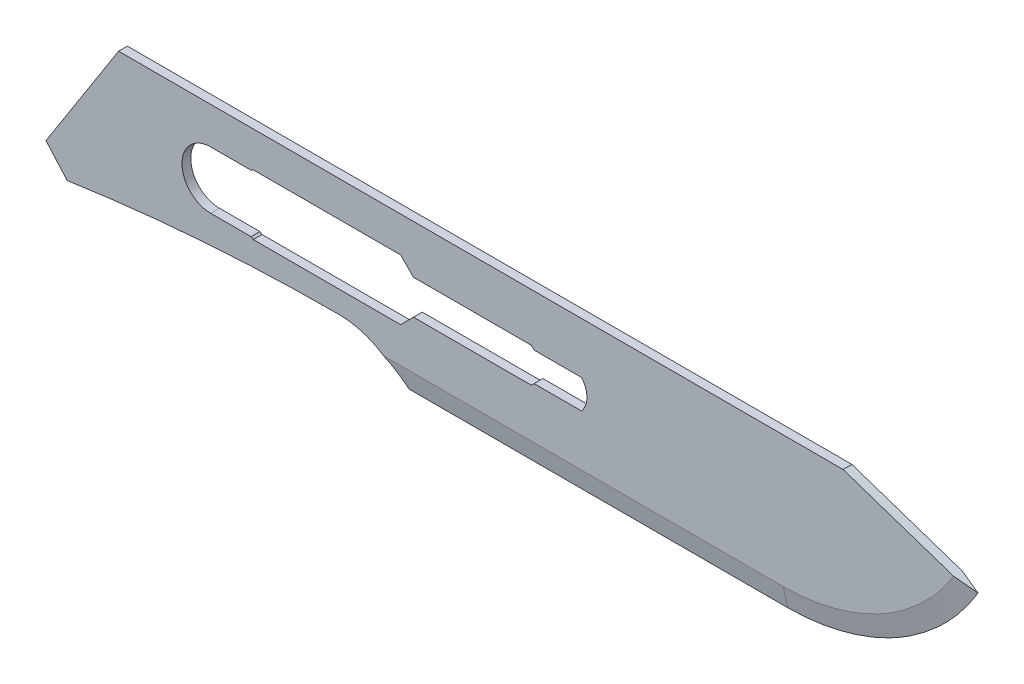
ISO-10303-21;
HEADER;
FILE_DESCRIPTION(('STEP AP214'),'2;1');
FILE_NAME('part.step','',(''),(''),'','','');
FILE_SCHEMA(('AUTOMOTIVE_DESIGN { 1 0 10303 214 1 1 1 1 }'));
ENDSEC;
DATA;
#1=APPLICATION_CONTEXT('core data for automotive mechanical design processes');
#2=APPLICATION_PROTOCOL_DEFINITION('international standard','automotive_design',2000,#1);
#3=PRODUCT_CONTEXT('',#1,'mechanical');
#4=PRODUCT('Part','Part','',(#3));
#5=PRODUCT_RELATED_PRODUCT_CATEGORY('part','',(#4));
#6=PRODUCT_DEFINITION_FORMATION('','',#4);
#7=PRODUCT_DEFINITION_CONTEXT('part definition',#1,'design');
#8=PRODUCT_DEFINITION('design','',#6,#7);
#9=PRODUCT_DEFINITION_SHAPE('','',#8);
#10=(LENGTH_UNIT() NAMED_UNIT(*) SI_UNIT(.MILLI.,.METRE.));
#11=(NAMED_UNIT(*) PLANE_ANGLE_UNIT() SI_UNIT($,.RADIAN.));
#12=(NAMED_UNIT(*) SI_UNIT($,.STERADIAN.) SOLID_ANGLE_UNIT());
#13=UNCERTAINTY_MEASURE_WITH_UNIT(LENGTH_MEASURE(1.E-05),#10,'distance_accuracy_value','');
#14=(GEOMETRIC_REPRESENTATION_CONTEXT(3) GLOBAL_UNCERTAINTY_ASSIGNED_CONTEXT((#13)) GLOBAL_UNIT_ASSIGNED_CONTEXT((#10,
#11,#12)) REPRESENTATION_CONTEXT('',''));
#15=CARTESIAN_POINT('',(0.,0.,0.));
#16=DIRECTION('',(0.,0.,1.));
#17=DIRECTION('',(1.,0.,0.));
#18=AXIS2_PLACEMENT_3D('',#15,#16,#17);
#19=CARTESIAN_POINT('',(-8.255,4.95241381146608,0.1905));
#20=DIRECTION('',(0.,0.,-1.));
#21=DIRECTION('',(-1.,0.,0.));
#22=AXIS2_PLACEMENT_3D('',#19,#20,#21);
#23=PLANE('',#22);
#24=CARTESIAN_POINT('',(-27.5063043070527,-6.6809007025944,0.1905));
#25=DIRECTION('',(0.,0.,-1.));
#26=DIRECTION('',(1.,0.,0.));
#27=AXIS2_PLACEMENT_3D('',#24,#25,#26);
#28=CIRCLE('',#27,3.4798);
#29=CARTESIAN_POINT('',(-27.50566,-3.20110076224317,0.1905));
#30=VERTEX_POINT('',#29);
#31=CARTESIAN_POINT('',(-25.5765775147167,-3.78518618853392,0.1905));
#32=VERTEX_POINT('',#31);
#33=EDGE_CURVE('E221',#30,#32,#28,.T.);
#34=ORIENTED_EDGE('',*,*,#33,.T.);
#35=DIRECTION('',(1.,0.,0.));
#36=VECTOR('',#35,1.);
#37=CARTESIAN_POINT('',(-28.4768617530592,-3.78518618853392,0.1905));
#38=LINE('',#37,#36);
#39=CARTESIAN_POINT('',(-8.255,-3.78518618853392,0.1905));
#40=VERTEX_POINT('',#39);
#41=EDGE_CURVE('E207',#32,#40,#38,.T.);
#42=ORIENTED_EDGE('',*,*,#41,.T.);
#43=CARTESIAN_POINT('',(-8.255,-3.78518618853392,0.1905));
#44=CARTESIAN_POINT('',(-6.63074292012557,-3.78518618853392,0.1905));
#45=CARTESIAN_POINT('',(-4.89180606923125,-3.28825967373008,0.1905));
#46=CARTESIAN_POINT('',(-2.76347399748939,-1.89648040564571,0.1905));
#47=CARTESIAN_POINT('',(-2.1160321854911,-1.31829233518276,0.1905));
#48=CARTESIAN_POINT('',(-1.0631161660207,-0.0760397170998346,0.1905));
#49=CARTESIAN_POINT('',(-0.654782385122332,0.625542975857833,0.1905));
#50=CARTESIAN_POINT('',(-0.26375087755055,1.36218278976257,0.1905));
#51=B_SPLINE_CURVE_WITH_KNOTS('',3,(#43,#44,#45,#46,#47,#48,#49,#50),.UNSPECIFIED.,.F.,.F.,(4,2,
2,4),(0.647701537141901,0.823850768570951,0.911925384285475,1.),.UNSPECIFIED.);
#52=CARTESIAN_POINT('',(-0.873085363511316,0.293638575171968,0.1905));
#53=VERTEX_POINT('',#52);
#54=EDGE_CURVE('E288',#40,#53,#51,.T.);
#55=ORIENTED_EDGE('',*,*,#54,.T.);
#56=DIRECTION('',(-0.947829798780356,0.318776838154828,0.));
#57=VECTOR('',#56,1.);
#58=CARTESIAN_POINT('',(0.,0.,0.1905));
#59=LINE('',#58,#57);
#60=CARTESIAN_POINT('',(-5.6642,1.905,0.1905));
#61=VERTEX_POINT('',#60);
#62=EDGE_CURVE('E250',#53,#61,#59,.T.);
#63=ORIENTED_EDGE('',*,*,#62,.T.);
#64=DIRECTION('',(-1.,0.,0.));
#65=VECTOR('',#64,1.);
#66=CARTESIAN_POINT('',(-5.6642,1.905,0.1905));
#67=LINE('',#66,#65);
#68=CARTESIAN_POINT('',(-37.06114,1.905,0.1905));
#69=VERTEX_POINT('',#68);
#70=EDGE_CURVE('E418',#61,#69,#67,.T.);
#71=ORIENTED_EDGE('',*,*,#70,.T.);
#72=DIRECTION('',(-0.538252158410651,-0.842783847713205,0.));
#73=VECTOR('',#72,1.);
#74=CARTESIAN_POINT('',(-40.2082,-3.0226,0.1905));
#75=LINE('',#74,#73);
#76=CARTESIAN_POINT('',(-40.2082,-3.0226,0.1905));
#77=VERTEX_POINT('',#76);
#78=EDGE_CURVE('E263',#69,#77,#75,.T.);
#79=ORIENTED_EDGE('',*,*,#78,.T.);
#80=DIRECTION('',(0.659801173215096,-0.751440225050524,0.));
#81=VECTOR('',#80,1.);
#82=CARTESIAN_POINT('',(-39.2938,-4.064,0.1905));
#83=LINE('',#82,#81);
#84=CARTESIAN_POINT('',(-39.2938,-4.064,0.1905));
#85=VERTEX_POINT('',#84);
#86=EDGE_CURVE('E234',#77,#85,#83,.T.);
#87=ORIENTED_EDGE('',*,*,#86,.T.);
#88=CARTESIAN_POINT('',(-27.5206107454063,-83.9476993781304,0.1905));
#89=DIRECTION('',(0.,0.,-1.));
#90=DIRECTION('',(1.,0.,0.));
#91=AXIS2_PLACEMENT_3D('',#88,#89,#90);
#92=CIRCLE('',#91,80.7466);
#93=EDGE_CURVE('E228',#85,#30,#92,.T.);
#94=ORIENTED_EDGE('',*,*,#93,.T.);
#95=EDGE_LOOP('',(#34,#42,#55,#63,#71,#79,#87,#94));
#96=FACE_BOUND('',#95,.T.);
#97=DIRECTION('',(-0.815327202637733,-0.579000477235494,0.));
#98=VECTOR('',#97,1.);
#99=CARTESIAN_POINT('',(-31.3182,0.3048,0.1905));
#100=LINE('',#99,#98);
#101=CARTESIAN_POINT('',(-31.2287816326531,0.3683,0.1905));
#102=VERTEX_POINT('',#101);
#103=CARTESIAN_POINT('',(-31.3182,0.3048,0.1905));
#104=VERTEX_POINT('',#103);
#105=EDGE_CURVE('E303',#102,#104,#100,.T.);
#106=ORIENTED_EDGE('',*,*,#105,.F.);
#107=DIRECTION('',(-1.,0.,0.));
#108=VECTOR('',#107,1.);
#109=CARTESIAN_POINT('',(-31.2287816326531,0.3683,0.1905));
#110=LINE('',#109,#108);
#111=CARTESIAN_POINT('',(-24.8412,0.3683,0.1905));
#112=VERTEX_POINT('',#111);
#113=EDGE_CURVE('E482',#112,#102,#110,.T.);
#114=ORIENTED_EDGE('',*,*,#113,.F.);
#115=DIRECTION('',(-0.707106781186546,0.707106781186549,0.));
#116=VECTOR('',#115,1.);
#117=CARTESIAN_POINT('',(-24.8412,0.3683,0.1905));
#118=LINE('',#117,#116);
#119=CARTESIAN_POINT('',(-24.2824,-0.1905,0.1905));
#120=VERTEX_POINT('',#119);
#121=EDGE_CURVE('E531',#120,#112,#118,.T.);
#122=ORIENTED_EDGE('',*,*,#121,.F.);
#123=DIRECTION('',(-1.,0.,0.));
#124=VECTOR('',#123,1.);
#125=CARTESIAN_POINT('',(-24.2824,-0.1905,0.1905));
#126=LINE('',#125,#124);
#127=CARTESIAN_POINT('',(-19.177,-0.1905,0.1905));
#128=VERTEX_POINT('',#127);
#129=EDGE_CURVE('E533',#128,#120,#126,.T.);
#130=ORIENTED_EDGE('',*,*,#129,.F.);
#131=DIRECTION('',(-0.707106781186547,0.707106781186547,0.));
#132=VECTOR('',#131,1.);
#133=CARTESIAN_POINT('',(-19.177,-0.1905,0.1905));
#134=LINE('',#133,#132);
#135=CARTESIAN_POINT('',(-19.05635,-0.31115,0.1905));
#136=VERTEX_POINT('',#135);
#137=EDGE_CURVE('E535',#136,#128,#134,.T.);
#138=ORIENTED_EDGE('',*,*,#137,.F.);
#139=DIRECTION('',(-1.,0.,0.));
#140=VECTOR('',#139,1.);
#141=CARTESIAN_POINT('',(-19.05635,-0.31115,0.1905));
#142=LINE('',#141,#140);
#143=CARTESIAN_POINT('',(-16.99895,-0.31115,0.1905));
#144=VERTEX_POINT('',#143);
#145=EDGE_CURVE('E537',#144,#136,#142,.T.);
#146=ORIENTED_EDGE('',*,*,#145,.F.);
#147=CARTESIAN_POINT('',(-17.7313503123293,-0.9398,0.1905));
#148=DIRECTION('',(0.,0.,1.));
#149=DIRECTION('',(-1.,0.,0.));
#150=AXIS2_PLACEMENT_3D('',#147,#148,#149);
#151=CIRCLE('',#150,0.965199999999999);
#152=CARTESIAN_POINT('',(-16.99895,-1.56845,0.1905));
#153=VERTEX_POINT('',#152);
#154=EDGE_CURVE('E539',#153,#144,#151,.T.);
#155=ORIENTED_EDGE('',*,*,#154,.F.);
#156=DIRECTION('',(1.,0.,0.));
#157=VECTOR('',#156,1.);
#158=CARTESIAN_POINT('',(-19.05635,-1.56845,0.1905));
#159=LINE('',#158,#157);
#160=CARTESIAN_POINT('',(-19.05635,-1.56845,0.1905));
#161=VERTEX_POINT('',#160);
#162=EDGE_CURVE('E541',#161,#153,#159,.T.);
#163=ORIENTED_EDGE('',*,*,#162,.F.);
#164=DIRECTION('',(0.707106781186547,0.707106781186547,0.));
#165=VECTOR('',#164,1.);
#166=CARTESIAN_POINT('',(-19.177,-1.6891,0.1905));
#167=LINE('',#166,#165);
#168=CARTESIAN_POINT('',(-19.177,-1.6891,0.1905));
#169=VERTEX_POINT('',#168);
#170=EDGE_CURVE('E543',#169,#161,#167,.T.);
#171=ORIENTED_EDGE('',*,*,#170,.F.);
#172=DIRECTION('',(1.,0.,0.));
#173=VECTOR('',#172,1.);
#174=CARTESIAN_POINT('',(-24.2824,-1.6891,0.1905));
#175=LINE('',#174,#173);
#176=CARTESIAN_POINT('',(-24.2824,-1.6891,0.1905));
#177=VERTEX_POINT('',#176);
#178=EDGE_CURVE('E545',#177,#169,#175,.T.);
#179=ORIENTED_EDGE('',*,*,#178,.F.);
#180=DIRECTION('',(0.707106781186544,0.707106781186551,0.));
#181=VECTOR('',#180,1.);
#182=CARTESIAN_POINT('',(-24.8412,-2.2479,0.1905));
#183=LINE('',#182,#181);
#184=CARTESIAN_POINT('',(-24.8412,-2.2479,0.1905));
#185=VERTEX_POINT('',#184);
#186=EDGE_CURVE('E547',#185,#177,#183,.T.);
#187=ORIENTED_EDGE('',*,*,#186,.F.);
#188=DIRECTION('',(1.,0.,0.));
#189=VECTOR('',#188,1.);
#190=CARTESIAN_POINT('',(-31.2287816326531,-2.2479,0.1905));
#191=LINE('',#190,#189);
#192=CARTESIAN_POINT('',(-31.2287816326531,-2.2479,0.1905));
#193=VERTEX_POINT('',#192);
#194=EDGE_CURVE('E549',#193,#185,#191,.T.);
#195=ORIENTED_EDGE('',*,*,#194,.F.);
#196=DIRECTION('',(0.815327202637734,-0.579000477235492,0.));
#197=VECTOR('',#196,1.);
#198=CARTESIAN_POINT('',(-31.3182,-2.1844,0.1905));
#199=LINE('',#198,#197);
#200=CARTESIAN_POINT('',(-31.3182,-2.1844,0.1905));
#201=VERTEX_POINT('',#200);
#202=EDGE_CURVE('E551',#201,#193,#199,.T.);
#203=ORIENTED_EDGE('',*,*,#202,.F.);
#204=DIRECTION('',(1.,0.,0.));
#205=VECTOR('',#204,1.);
#206=CARTESIAN_POINT('',(-33.0708,-2.1844,0.1905));
#207=LINE('',#206,#205);
#208=CARTESIAN_POINT('',(-33.0708,-2.1844,0.1905));
#209=VERTEX_POINT('',#208);
#210=EDGE_CURVE('E553',#209,#201,#207,.T.);
#211=ORIENTED_EDGE('',*,*,#210,.F.);
#212=CARTESIAN_POINT('',(-33.0708,-0.9398,0.1905));
#213=DIRECTION('',(0.,0.,1.));
#214=DIRECTION('',(1.,0.,0.));
#215=AXIS2_PLACEMENT_3D('',#212,#213,#214);
#216=CIRCLE('',#215,1.2446);
#217=CARTESIAN_POINT('',(-33.0708,0.3048,0.1905));
#218=VERTEX_POINT('',#217);
#219=EDGE_CURVE('E555',#218,#209,#216,.T.);
#220=ORIENTED_EDGE('',*,*,#219,.F.);
#221=DIRECTION('',(-1.,0.,0.));
#222=VECTOR('',#221,1.);
#223=CARTESIAN_POINT('',(-33.0708,0.3048,0.1905));
#224=LINE('',#223,#222);
#225=EDGE_CURVE('E556',#104,#218,#224,.T.);
#226=ORIENTED_EDGE('',*,*,#225,.F.);
#227=EDGE_LOOP('',(#106,#114,#122,#130,#138,#146,#155,#163,#171,#179,#187,#195,#203,#211,#220,#226));
#228=FACE_BOUND('',#227,.T.);
#229=ADVANCED_FACE('F32',(#96,#228),#23,.F.);
#230=CARTESIAN_POINT('',(-8.255,4.95241381146608,-0.1905));
#231=DIRECTION('',(0.,0.,-1.));
#232=DIRECTION('',(-1.,0.,0.));
#233=AXIS2_PLACEMENT_3D('',#230,#231,#232);
#234=PLANE('',#233);
#235=DIRECTION('',(1.,0.,0.));
#236=VECTOR('',#235,1.);
#237=CARTESIAN_POINT('',(-28.4768617530592,-3.78518618853392,-0.1905));
#238=LINE('',#237,#236);
#239=CARTESIAN_POINT('',(-25.5765775147167,-3.78518618853392,-0.1905));
#240=VERTEX_POINT('',#239);
#241=CARTESIAN_POINT('',(-8.255,-3.78518618853392,-0.1905));
#242=VERTEX_POINT('',#241);
#243=EDGE_CURVE('E214',#240,#242,#238,.T.);
#244=ORIENTED_EDGE('',*,*,#243,.F.);
#245=CARTESIAN_POINT('',(-27.5063043070527,-6.6809007025944,-0.1905));
#246=DIRECTION('',(0.,0.,-1.));
#247=DIRECTION('',(1.,0.,0.));
#248=AXIS2_PLACEMENT_3D('',#245,#246,#247);
#249=CIRCLE('',#248,3.4798);
#250=CARTESIAN_POINT('',(-27.50566,-3.20110076224317,-0.1905));
#251=VERTEX_POINT('',#250);
#252=EDGE_CURVE('E249',#251,#240,#249,.T.);
#253=ORIENTED_EDGE('',*,*,#252,.F.);
#254=CARTESIAN_POINT('',(-27.5206107454063,-83.9476993781304,-0.1905));
#255=DIRECTION('',(0.,0.,-1.));
#256=DIRECTION('',(1.,0.,0.));
#257=AXIS2_PLACEMENT_3D('',#254,#255,#256);
#258=CIRCLE('',#257,80.7466);
#259=CARTESIAN_POINT('',(-39.2938,-4.064,-0.1905));
#260=VERTEX_POINT('',#259);
#261=EDGE_CURVE('E247',#260,#251,#258,.T.);
#262=ORIENTED_EDGE('',*,*,#261,.F.);
#263=DIRECTION('',(0.659801173215096,-0.751440225050524,0.));
#264=VECTOR('',#263,1.);
#265=CARTESIAN_POINT('',(-39.2938,-4.064,-0.1905));
#266=LINE('',#265,#264);
#267=CARTESIAN_POINT('',(-40.2082,-3.0226,-0.1905));
#268=VERTEX_POINT('',#267);
#269=EDGE_CURVE('E245',#268,#260,#266,.T.);
#270=ORIENTED_EDGE('',*,*,#269,.F.);
#271=DIRECTION('',(-0.538252158410651,-0.842783847713205,0.));
#272=VECTOR('',#271,1.);
#273=CARTESIAN_POINT('',(-40.2082,-3.0226,-0.1905));
#274=LINE('',#273,#272);
#275=CARTESIAN_POINT('',(-37.06114,1.905,-0.1905));
#276=VERTEX_POINT('',#275);
#277=EDGE_CURVE('E243',#276,#268,#274,.T.);
#278=ORIENTED_EDGE('',*,*,#277,.F.);
#279=DIRECTION('',(-1.,0.,0.));
#280=VECTOR('',#279,1.);
#281=CARTESIAN_POINT('',(-5.6642,1.905,-0.1905));
#282=LINE('',#281,#280);
#283=CARTESIAN_POINT('',(-5.6642,1.905,-0.1905));
#284=VERTEX_POINT('',#283);
#285=EDGE_CURVE('E240',#284,#276,#282,.T.);
#286=ORIENTED_EDGE('',*,*,#285,.F.);
#287=DIRECTION('',(-0.947829798780356,0.318776838154828,0.));
#288=VECTOR('',#287,1.);
#289=CARTESIAN_POINT('',(0.,0.,-0.1905));
#290=LINE('',#289,#288);
#291=CARTESIAN_POINT('',(-0.873085363513939,0.293638575169909,-0.1905));
#292=VERTEX_POINT('',#291);
#293=EDGE_CURVE('E238',#292,#284,#290,.T.);
#294=ORIENTED_EDGE('',*,*,#293,.F.);
#295=CARTESIAN_POINT('',(-8.255,-3.78518618853392,-0.1905));
#296=CARTESIAN_POINT('',(-6.63074292012557,-3.78518618853392,-0.1905));
#297=CARTESIAN_POINT('',(-4.89180606923125,-3.28825967372683,-0.1905));
#298=CARTESIAN_POINT('',(-2.76347399748939,-1.89648040564734,-0.1905));
#299=CARTESIAN_POINT('',(-2.11603218549031,-1.31829233518276,-0.1905));
#300=CARTESIAN_POINT('',(-1.06311616602148,-0.0760397170998348,-0.1905));
#301=CARTESIAN_POINT('',(-0.654782385125785,0.625542975859977,-0.1905));
#302=CARTESIAN_POINT('',(-0.263750877550548,1.36218278976257,-0.1905));
#303=B_SPLINE_CURVE_WITH_KNOTS('',3,(#295,#296,#297,#298,#299,#300,#301,#302),.UNSPECIFIED.,.F.,
.F.,(4,2,2,4),(0.647701537141901,0.823850768570951,0.911925384285475,1.),.UNSPECIFIED.);
#304=EDGE_CURVE('E282',#242,#292,#303,.T.);
#305=ORIENTED_EDGE('',*,*,#304,.F.);
#306=EDGE_LOOP('',(#244,#253,#262,#270,#278,#286,#294,#305));
#307=FACE_BOUND('',#306,.T.);
#308=DIRECTION('',(-1.,0.,0.));
#309=VECTOR('',#308,1.);
#310=CARTESIAN_POINT('',(-31.2287816326531,0.3683,-0.1905));
#311=LINE('',#310,#309);
#312=CARTESIAN_POINT('',(-24.8412,0.3683,-0.1905));
#313=VERTEX_POINT('',#312);
#314=CARTESIAN_POINT('',(-31.2287816326531,0.3683,-0.1905));
#315=VERTEX_POINT('',#314);
#316=EDGE_CURVE('E483',#313,#315,#311,.T.);
#317=ORIENTED_EDGE('',*,*,#316,.T.);
#318=DIRECTION('',(-0.815327202637733,-0.579000477235494,0.));
#319=VECTOR('',#318,1.);
#320=CARTESIAN_POINT('',(-31.3182,0.3048,-0.1905));
#321=LINE('',#320,#319);
#322=CARTESIAN_POINT('',(-31.3182,0.3048,-0.1905));
#323=VERTEX_POINT('',#322);
#324=EDGE_CURVE('E301',#315,#323,#321,.T.);
#325=ORIENTED_EDGE('',*,*,#324,.T.);
#326=DIRECTION('',(-1.,0.,0.));
#327=VECTOR('',#326,1.);
#328=CARTESIAN_POINT('',(-33.0708,0.3048,-0.1905));
#329=LINE('',#328,#327);
#330=CARTESIAN_POINT('',(-33.0708,0.3048,-0.1905));
#331=VERTEX_POINT('',#330);
#332=EDGE_CURVE('E525',#323,#331,#329,.T.);
#333=ORIENTED_EDGE('',*,*,#332,.T.);
#334=CARTESIAN_POINT('',(-33.0708,-0.9398,-0.1905));
#335=DIRECTION('',(0.,0.,1.));
#336=DIRECTION('',(1.,0.,0.));
#337=AXIS2_PLACEMENT_3D('',#334,#335,#336);
#338=CIRCLE('',#337,1.2446);
#339=CARTESIAN_POINT('',(-33.0708,-2.1844,-0.1905));
#340=VERTEX_POINT('',#339);
#341=EDGE_CURVE('E522',#331,#340,#338,.T.);
#342=ORIENTED_EDGE('',*,*,#341,.T.);
#343=DIRECTION('',(1.,0.,0.));
#344=VECTOR('',#343,1.);
#345=CARTESIAN_POINT('',(-33.0708,-2.1844,-0.1905));
#346=LINE('',#345,#344);
#347=CARTESIAN_POINT('',(-31.3182,-2.1844,-0.1905));
#348=VERTEX_POINT('',#347);
#349=EDGE_CURVE('E519',#340,#348,#346,.T.);
#350=ORIENTED_EDGE('',*,*,#349,.T.);
#351=DIRECTION('',(0.815327202637734,-0.579000477235492,0.));
#352=VECTOR('',#351,1.);
#353=CARTESIAN_POINT('',(-31.3182,-2.1844,-0.1905));
#354=LINE('',#353,#352);
#355=CARTESIAN_POINT('',(-31.2287816326531,-2.2479,-0.1905));
#356=VERTEX_POINT('',#355);
#357=EDGE_CURVE('E516',#348,#356,#354,.T.);
#358=ORIENTED_EDGE('',*,*,#357,.T.);
#359=DIRECTION('',(1.,0.,0.));
#360=VECTOR('',#359,1.);
#361=CARTESIAN_POINT('',(-31.2287816326531,-2.2479,-0.1905));
#362=LINE('',#361,#360);
#363=CARTESIAN_POINT('',(-24.8412,-2.2479,-0.1905));
#364=VERTEX_POINT('',#363);
#365=EDGE_CURVE('E513',#356,#364,#362,.T.);
#366=ORIENTED_EDGE('',*,*,#365,.T.);
#367=DIRECTION('',(0.707106781186544,0.707106781186551,0.));
#368=VECTOR('',#367,1.);
#369=CARTESIAN_POINT('',(-24.8412,-2.2479,-0.1905));
#370=LINE('',#369,#368);
#371=CARTESIAN_POINT('',(-24.2824,-1.6891,-0.1905));
#372=VERTEX_POINT('',#371);
#373=EDGE_CURVE('E510',#364,#372,#370,.T.);
#374=ORIENTED_EDGE('',*,*,#373,.T.);
#375=DIRECTION('',(1.,0.,0.));
#376=VECTOR('',#375,1.);
#377=CARTESIAN_POINT('',(-24.2824,-1.6891,-0.1905));
#378=LINE('',#377,#376);
#379=CARTESIAN_POINT('',(-19.177,-1.6891,-0.1905));
#380=VERTEX_POINT('',#379);
#381=EDGE_CURVE('E507',#372,#380,#378,.T.);
#382=ORIENTED_EDGE('',*,*,#381,.T.);
#383=DIRECTION('',(0.707106781186547,0.707106781186547,0.));
#384=VECTOR('',#383,1.);
#385=CARTESIAN_POINT('',(-19.177,-1.6891,-0.1905));
#386=LINE('',#385,#384);
#387=CARTESIAN_POINT('',(-19.05635,-1.56845,-0.1905));
#388=VERTEX_POINT('',#387);
#389=EDGE_CURVE('E504',#380,#388,#386,.T.);
#390=ORIENTED_EDGE('',*,*,#389,.T.);
#391=DIRECTION('',(1.,0.,0.));
#392=VECTOR('',#391,1.);
#393=CARTESIAN_POINT('',(-19.05635,-1.56845,-0.1905));
#394=LINE('',#393,#392);
#395=CARTESIAN_POINT('',(-16.99895,-1.56845,-0.1905));
#396=VERTEX_POINT('',#395);
#397=EDGE_CURVE('E501',#388,#396,#394,.T.);
#398=ORIENTED_EDGE('',*,*,#397,.T.);
#399=CARTESIAN_POINT('',(-17.7313503123293,-0.9398,-0.1905));
#400=DIRECTION('',(0.,0.,1.));
#401=DIRECTION('',(-1.,0.,0.));
#402=AXIS2_PLACEMENT_3D('',#399,#400,#401);
#403=CIRCLE('',#402,0.965199999999999);
#404=CARTESIAN_POINT('',(-16.99895,-0.31115,-0.1905));
#405=VERTEX_POINT('',#404);
#406=EDGE_CURVE('E498',#396,#405,#403,.T.);
#407=ORIENTED_EDGE('',*,*,#406,.T.);
#408=DIRECTION('',(-1.,0.,0.));
#409=VECTOR('',#408,1.);
#410=CARTESIAN_POINT('',(-19.05635,-0.31115,-0.1905));
#411=LINE('',#410,#409);
#412=CARTESIAN_POINT('',(-19.05635,-0.31115,-0.1905));
#413=VERTEX_POINT('',#412);
#414=EDGE_CURVE('E495',#405,#413,#411,.T.);
#415=ORIENTED_EDGE('',*,*,#414,.T.);
#416=DIRECTION('',(-0.707106781186547,0.707106781186547,0.));
#417=VECTOR('',#416,1.);
#418=CARTESIAN_POINT('',(-19.177,-0.1905,-0.1905));
#419=LINE('',#418,#417);
#420=CARTESIAN_POINT('',(-19.177,-0.1905,-0.1905));
#421=VERTEX_POINT('',#420);
#422=EDGE_CURVE('E492',#413,#421,#419,.T.);
#423=ORIENTED_EDGE('',*,*,#422,.T.);
#424=DIRECTION('',(-1.,0.,0.));
#425=VECTOR('',#424,1.);
#426=CARTESIAN_POINT('',(-24.2824,-0.1905,-0.1905));
#427=LINE('',#426,#425);
#428=CARTESIAN_POINT('',(-24.2824,-0.1905,-0.1905));
#429=VERTEX_POINT('',#428);
#430=EDGE_CURVE('E489',#421,#429,#427,.T.);
#431=ORIENTED_EDGE('',*,*,#430,.T.);
#432=DIRECTION('',(-0.707106781186546,0.707106781186549,0.));
#433=VECTOR('',#432,1.);
#434=CARTESIAN_POINT('',(-24.8412,0.3683,-0.1905));
#435=LINE('',#434,#433);
#436=EDGE_CURVE('E486',#429,#313,#435,.T.);
#437=ORIENTED_EDGE('',*,*,#436,.T.);
#438=EDGE_LOOP('',(#317,#325,#333,#342,#350,#358,#366,#374,#382,#390,#398,#407,#415,#423,#431,#437));
#439=FACE_BOUND('',#438,.T.);
#440=ADVANCED_FACE('F270',(#307,#439),#234,.T.);
#441=CARTESIAN_POINT('',(0.,0.,0.1905));
#442=DIRECTION('',(-0.318776838154828,-0.947829798780356,0.));
#443=DIRECTION('',(0.947829798780356,-0.318776838154828,0.));
#444=AXIS2_PLACEMENT_3D('',#441,#442,#443);
#445=PLANE('',#444);
#446=ORIENTED_EDGE('',*,*,#62,.F.);
#447=CARTESIAN_POINT('',(-0.00837804364182573,0.00281772901229552,0.));
#448=CARTESIAN_POINT('',(-0.0804317013365272,0.0270510211830601,0.0159016611723972));
#449=CARTESIAN_POINT('',(-0.152486526241127,0.0512847063011537,0.0317974359889447));
#450=CARTESIAN_POINT('',(-0.296598739712396,0.0997529391988856,0.0635760440530303));
#451=CARTESIAN_POINT('',(-0.368656128279066,0.123987486978524,0.0794588773005608));
#452=CARTESIAN_POINT('',(-0.584832505427802,0.196692546890205,0.127086216270913));
#453=CARTESIAN_POINT('',(-0.728955683244341,0.245164468123849,0.158809556318238));
#454=CARTESIAN_POINT('',(-0.873085363510762,0.293638575171625,0.1905));
#455=B_SPLINE_CURVE_WITH_KNOTS('',3,(#447,#448,#449,#450,#451,#452,#453,#454),.UNSPECIFIED.,.F.,
.F.,(4,2,2,4),(0.,0.232994858047279,0.465989716227957,0.931979504422439),.UNSPECIFIED.);
#456=CARTESIAN_POINT('',(-0.00837804364182573,0.00281772901229552,0.));
#457=VERTEX_POINT('',#456);
#458=EDGE_CURVE('E302',#457,#53,#455,.T.);
#459=ORIENTED_EDGE('',*,*,#458,.F.);
#460=CARTESIAN_POINT('',(-0.873085363513495,0.29363857517123,-0.1905));
#461=CARTESIAN_POINT('',(-0.728955705384913,0.245164474904852,-0.158809561083026));
#462=CARTESIAN_POINT('',(-0.584832549350942,0.19669256144083,-0.127086225904364));
#463=CARTESIAN_POINT('',(-0.36865618414942,0.123987505879886,-0.0794588896312714));
#464=CARTESIAN_POINT('',(-0.29659878569629,0.0997529548306006,-0.0635760542164731));
#465=CARTESIAN_POINT('',(-0.152486550406082,0.0512847142620963,-0.0317974412940061));
#466=CARTESIAN_POINT('',(-0.0804317135690802,0.0270510247429035,-0.0159016637859519));
#467=CARTESIAN_POINT('',(-0.00837804406608126,0.00281772782489907,1.12801561678172E-10));
#468=B_SPLINE_CURVE_WITH_KNOTS('',3,(#460,#461,#462,#463,#464,#465,#466,#467),.UNSPECIFIED.,.F.,
.F.,(4,2,2,4),(0.,0.465989717304718,0.698984607393734,0.931979504424832),.UNSPECIFIED.);
#469=EDGE_CURVE('E292',#292,#457,#468,.T.);
#470=ORIENTED_EDGE('',*,*,#469,.F.);
#471=ORIENTED_EDGE('',*,*,#293,.T.);
#472=DIRECTION('',(0.,0.,-1.));
#473=VECTOR('',#472,1.);
#474=CARTESIAN_POINT('',(-5.6642,1.905,0.1905));
#475=LINE('',#474,#473);
#476=EDGE_CURVE('E11',#61,#284,#475,.T.);
#477=ORIENTED_EDGE('',*,*,#476,.F.);
#478=EDGE_LOOP('',(#446,#459,#470,#471,#477));
#479=FACE_BOUND('',#478,.T.);
#480=ADVANCED_FACE('F34',(#479),#445,.F.);
#481=CARTESIAN_POINT('',(-5.6642,1.905,0.1905));
#482=DIRECTION('',(0.,-1.,0.));
#483=DIRECTION('',(1.,0.,0.));
#484=AXIS2_PLACEMENT_3D('',#481,#482,#483);
#485=PLANE('',#484);
#486=ORIENTED_EDGE('',*,*,#285,.T.);
#487=DIRECTION('',(0.,0.,-1.));
#488=VECTOR('',#487,1.);
#489=CARTESIAN_POINT('',(-37.06114,1.905,0.1905));
#490=LINE('',#489,#488);
#491=EDGE_CURVE('E40',#69,#276,#490,.T.);
#492=ORIENTED_EDGE('',*,*,#491,.F.);
#493=ORIENTED_EDGE('',*,*,#70,.F.);
#494=ORIENTED_EDGE('',*,*,#476,.T.);
#495=EDGE_LOOP('',(#486,#492,#493,#494));
#496=FACE_BOUND('',#495,.T.);
#497=ADVANCED_FACE('F411',(#496),#485,.F.);
#498=CARTESIAN_POINT('',(-40.2082,-3.0226,0.1905));
#499=DIRECTION('',(0.842783847713205,-0.538252158410651,0.));
#500=DIRECTION('',(0.538252158410651,0.842783847713206,0.));
#501=AXIS2_PLACEMENT_3D('',#498,#499,#500);
#502=PLANE('',#501);
#503=ORIENTED_EDGE('',*,*,#277,.T.);
#504=DIRECTION('',(0.,0.,-1.));
#505=VECTOR('',#504,1.);
#506=CARTESIAN_POINT('',(-40.2082,-3.0226,0.1905));
#507=LINE('',#506,#505);
#508=EDGE_CURVE('E254',#77,#268,#507,.T.);
#509=ORIENTED_EDGE('',*,*,#508,.F.);
#510=ORIENTED_EDGE('',*,*,#78,.F.);
#511=ORIENTED_EDGE('',*,*,#491,.T.);
#512=EDGE_LOOP('',(#503,#509,#510,#511));
#513=FACE_BOUND('',#512,.T.);
#514=ADVANCED_FACE('F261',(#513),#502,.F.);
#515=CARTESIAN_POINT('',(-39.2938,-4.064,0.1905));
#516=DIRECTION('',(0.751440225050524,0.659801173215096,0.));
#517=DIRECTION('',(-0.659801173215096,0.751440225050524,0.));
#518=AXIS2_PLACEMENT_3D('',#515,#516,#517);
#519=PLANE('',#518);
#520=ORIENTED_EDGE('',*,*,#269,.T.);
#521=DIRECTION('',(0.,0.,-1.));
#522=VECTOR('',#521,1.);
#523=CARTESIAN_POINT('',(-39.2938,-4.064,0.1905));
#524=LINE('',#523,#522);
#525=EDGE_CURVE('E232',#85,#260,#524,.T.);
#526=ORIENTED_EDGE('',*,*,#525,.F.);
#527=ORIENTED_EDGE('',*,*,#86,.F.);
#528=ORIENTED_EDGE('',*,*,#508,.T.);
#529=EDGE_LOOP('',(#520,#526,#527,#528));
#530=FACE_BOUND('',#529,.T.);
#531=ADVANCED_FACE('F277',(#530),#519,.F.);
#532=CARTESIAN_POINT('',(-27.5206107454063,-83.9476993781304,0.1905));
#533=DIRECTION('',(0.,0.,-1.));
#534=DIRECTION('',(-1.,0.,0.));
#535=AXIS2_PLACEMENT_3D('',#532,#533,#534);
#536=CYLINDRICAL_SURFACE('',#535,80.7466);
#537=ORIENTED_EDGE('',*,*,#261,.T.);
#538=DIRECTION('',(0.,0.,-1.));
#539=VECTOR('',#538,1.);
#540=CARTESIAN_POINT('',(-27.50566,-3.20110076224317,0.1905));
#541=LINE('',#540,#539);
#542=EDGE_CURVE('E230',#30,#251,#541,.T.);
#543=ORIENTED_EDGE('',*,*,#542,.F.);
#544=ORIENTED_EDGE('',*,*,#93,.F.);
#545=ORIENTED_EDGE('',*,*,#525,.T.);
#546=EDGE_LOOP('',(#537,#543,#544,#545));
#547=FACE_BOUND('',#546,.T.);
#548=ADVANCED_FACE('F280',(#547),#536,.F.);
#549=CARTESIAN_POINT('',(-27.5063043070527,-6.6809007025944,0.1905));
#550=DIRECTION('',(0.,0.,-1.));
#551=DIRECTION('',(-1.,0.,0.));
#552=AXIS2_PLACEMENT_3D('',#549,#550,#551);
#553=CYLINDRICAL_SURFACE('',#552,3.4798);
#554=CARTESIAN_POINT('',(-27.5063043070527,-6.6809007025944,0.430010253012959));
#555=DIRECTION('',(0.,0.209529088730874,0.97780241407741));
#556=DIRECTION('',(0.,0.97780241407741,-0.209529088730874));
#557=AXIS2_PLACEMENT_3D('',#554,#555,#556);
#558=ELLIPSE('',#557,3.55879669542779,3.4798);
#559=CARTESIAN_POINT('',(-24.6634,-4.67418618853392,0.));
#560=VERTEX_POINT('',#559);
#561=EDGE_CURVE('E223',#560,#240,#558,.T.);
#562=ORIENTED_EDGE('',*,*,#561,.F.);
#563=CARTESIAN_POINT('',(-27.5063043070527,-6.6809007025944,-0.430010253012958));
#564=DIRECTION('',(0.,0.209529088730873,-0.977802414077409));
#565=DIRECTION('',(0.,-0.97780241407741,-0.209529088730873));
#566=AXIS2_PLACEMENT_3D('',#563,#564,#565);
#567=ELLIPSE('',#566,3.55879669542779,3.4798);
#568=EDGE_CURVE('E47',#32,#560,#567,.T.);
#569=ORIENTED_EDGE('',*,*,#568,.F.);
#570=ORIENTED_EDGE('',*,*,#33,.F.);
#571=ORIENTED_EDGE('',*,*,#542,.T.);
#572=ORIENTED_EDGE('',*,*,#252,.T.);
#573=EDGE_LOOP('',(#562,#569,#570,#571,#572));
#574=FACE_BOUND('',#573,.T.);
#575=ADVANCED_FACE('F219',(#574),#553,.F.);
#576=CARTESIAN_POINT('',(-31.3182,0.3048,0.1905));
#577=DIRECTION('',(0.579000477235494,-0.815327202637733,0.));
#578=DIRECTION('',(0.815327202637733,0.579000477235494,0.));
#579=AXIS2_PLACEMENT_3D('',#576,#577,#578);
#580=PLANE('',#579);
#581=ORIENTED_EDGE('',*,*,#324,.F.);
#582=DIRECTION('',(0.,0.,-1.));
#583=VECTOR('',#582,1.);
#584=CARTESIAN_POINT('',(-31.2287816326531,0.3683,0.1905));
#585=LINE('',#584,#583);
#586=EDGE_CURVE('E479',#102,#315,#585,.T.);
#587=ORIENTED_EDGE('',*,*,#586,.F.);
#588=ORIENTED_EDGE('',*,*,#105,.T.);
#589=DIRECTION('',(0.,0.,-1.));
#590=VECTOR('',#589,1.);
#591=CARTESIAN_POINT('',(-31.3182,0.3048,0.1905));
#592=LINE('',#591,#590);
#593=EDGE_CURVE('E241',#104,#323,#592,.T.);
#594=ORIENTED_EDGE('',*,*,#593,.T.);
#595=EDGE_LOOP('',(#581,#587,#588,#594));
#596=FACE_BOUND('',#595,.T.);
#597=ADVANCED_FACE('F395',(#596),#580,.T.);
#598=CARTESIAN_POINT('',(-33.0708,0.3048,0.1905));
#599=DIRECTION('',(0.,-1.,0.));
#600=DIRECTION('',(0.,0.,-1.));
#601=AXIS2_PLACEMENT_3D('',#598,#599,#600);
#602=PLANE('',#601);
#603=ORIENTED_EDGE('',*,*,#332,.F.);
#604=ORIENTED_EDGE('',*,*,#593,.F.);
#605=ORIENTED_EDGE('',*,*,#225,.T.);
#606=DIRECTION('',(0.,0.,-1.));
#607=VECTOR('',#606,1.);
#608=CARTESIAN_POINT('',(-33.0708,0.3048,0.1905));
#609=LINE('',#608,#607);
#610=EDGE_CURVE('E452',#218,#331,#609,.T.);
#611=ORIENTED_EDGE('',*,*,#610,.T.);
#612=EDGE_LOOP('',(#603,#604,#605,#611));
#613=FACE_BOUND('',#612,.T.);
#614=ADVANCED_FACE('F391',(#613),#602,.T.);
#615=CARTESIAN_POINT('',(-33.0708,-0.9398,0.1905));
#616=DIRECTION('',(0.,0.,-1.));
#617=DIRECTION('',(-1.,0.,0.));
#618=AXIS2_PLACEMENT_3D('',#615,#616,#617);
#619=CYLINDRICAL_SURFACE('',#618,1.2446);
#620=ORIENTED_EDGE('',*,*,#341,.F.);
#621=ORIENTED_EDGE('',*,*,#610,.F.);
#622=ORIENTED_EDGE('',*,*,#219,.T.);
#623=DIRECTION('',(0.,0.,-1.));
#624=VECTOR('',#623,1.);
#625=CARTESIAN_POINT('',(-33.0708,-2.1844,0.1905));
#626=LINE('',#625,#624);
#627=EDGE_CURVE('E454',#209,#340,#626,.T.);
#628=ORIENTED_EDGE('',*,*,#627,.T.);
#629=EDGE_LOOP('',(#620,#621,#622,#628));
#630=FACE_BOUND('',#629,.T.);
#631=ADVANCED_FACE('F387',(#630),#619,.F.);
#632=CARTESIAN_POINT('',(-33.0708,-2.1844,0.1905));
#633=DIRECTION('',(0.,1.,0.));
#634=DIRECTION('',(0.,0.,1.));
#635=AXIS2_PLACEMENT_3D('',#632,#633,#634);
#636=PLANE('',#635);
#637=ORIENTED_EDGE('',*,*,#349,.F.);
#638=ORIENTED_EDGE('',*,*,#627,.F.);
#639=ORIENTED_EDGE('',*,*,#210,.T.);
#640=DIRECTION('',(0.,0.,-1.));
#641=VECTOR('',#640,1.);
#642=CARTESIAN_POINT('',(-31.3182,-2.1844,0.1905));
#643=LINE('',#642,#641);
#644=EDGE_CURVE('E456',#201,#348,#643,.T.);
#645=ORIENTED_EDGE('',*,*,#644,.T.);
#646=EDGE_LOOP('',(#637,#638,#639,#645));
#647=FACE_BOUND('',#646,.T.);
#648=ADVANCED_FACE('F383',(#647),#636,.T.);
#649=CARTESIAN_POINT('',(-31.3182,-2.1844,0.1905));
#650=DIRECTION('',(0.579000477235492,0.815327202637734,0.));
#651=DIRECTION('',(-0.815327202637734,0.579000477235492,0.));
#652=AXIS2_PLACEMENT_3D('',#649,#650,#651);
#653=PLANE('',#652);
#654=ORIENTED_EDGE('',*,*,#357,.F.);
#655=ORIENTED_EDGE('',*,*,#644,.F.);
#656=ORIENTED_EDGE('',*,*,#202,.T.);
#657=DIRECTION('',(0.,0.,-1.));
#658=VECTOR('',#657,1.);
#659=CARTESIAN_POINT('',(-31.2287816326531,-2.2479,0.1905));
#660=LINE('',#659,#658);
#661=EDGE_CURVE('E458',#193,#356,#660,.T.);
#662=ORIENTED_EDGE('',*,*,#661,.T.);
#663=EDGE_LOOP('',(#654,#655,#656,#662));
#664=FACE_BOUND('',#663,.T.);
#665=ADVANCED_FACE('F379',(#664),#653,.T.);
#666=CARTESIAN_POINT('',(-31.2287816326531,-2.2479,0.1905));
#667=DIRECTION('',(0.,1.,0.));
#668=DIRECTION('',(0.,0.,1.));
#669=AXIS2_PLACEMENT_3D('',#666,#667,#668);
#670=PLANE('',#669);
#671=ORIENTED_EDGE('',*,*,#365,.F.);
#672=ORIENTED_EDGE('',*,*,#661,.F.);
#673=ORIENTED_EDGE('',*,*,#194,.T.);
#674=DIRECTION('',(0.,0.,-1.));
#675=VECTOR('',#674,1.);
#676=CARTESIAN_POINT('',(-24.8412,-2.2479,0.1905));
#677=LINE('',#676,#675);
#678=EDGE_CURVE('E460',#185,#364,#677,.T.);
#679=ORIENTED_EDGE('',*,*,#678,.T.);
#680=EDGE_LOOP('',(#671,#672,#673,#679));
#681=FACE_BOUND('',#680,.T.);
#682=ADVANCED_FACE('F375',(#681),#670,.T.);
#683=CARTESIAN_POINT('',(-24.8412,-2.2479,0.1905));
#684=DIRECTION('',(-0.70710678118655,0.707106781186544,0.));
#685=DIRECTION('',(-0.707106781186544,-0.707106781186551,0.));
#686=AXIS2_PLACEMENT_3D('',#683,#684,#685);
#687=PLANE('',#686);
#688=ORIENTED_EDGE('',*,*,#373,.F.);
#689=ORIENTED_EDGE('',*,*,#678,.F.);
#690=ORIENTED_EDGE('',*,*,#186,.T.);
#691=DIRECTION('',(0.,0.,-1.));
#692=VECTOR('',#691,1.);
#693=CARTESIAN_POINT('',(-24.2824,-1.6891,0.1905));
#694=LINE('',#693,#692);
#695=EDGE_CURVE('E462',#177,#372,#694,.T.);
#696=ORIENTED_EDGE('',*,*,#695,.T.);
#697=EDGE_LOOP('',(#688,#689,#690,#696));
#698=FACE_BOUND('',#697,.T.);
#699=ADVANCED_FACE('F371',(#698),#687,.T.);
#700=CARTESIAN_POINT('',(-24.2824,-1.6891,0.1905));
#701=DIRECTION('',(0.,1.,0.));
#702=DIRECTION('',(0.,0.,1.));
#703=AXIS2_PLACEMENT_3D('',#700,#701,#702);
#704=PLANE('',#703);
#705=ORIENTED_EDGE('',*,*,#381,.F.);
#706=ORIENTED_EDGE('',*,*,#695,.F.);
#707=ORIENTED_EDGE('',*,*,#178,.T.);
#708=DIRECTION('',(0.,0.,-1.));
#709=VECTOR('',#708,1.);
#710=CARTESIAN_POINT('',(-19.177,-1.6891,0.1905));
#711=LINE('',#710,#709);
#712=EDGE_CURVE('E464',#169,#380,#711,.T.);
#713=ORIENTED_EDGE('',*,*,#712,.T.);
#714=EDGE_LOOP('',(#705,#706,#707,#713));
#715=FACE_BOUND('',#714,.T.);
#716=ADVANCED_FACE('F367',(#715),#704,.T.);
#717=CARTESIAN_POINT('',(-19.177,-1.6891,0.1905));
#718=DIRECTION('',(-0.707106781186547,0.707106781186547,0.));
#719=DIRECTION('',(-0.707106781186548,-0.707106781186548,0.));
#720=AXIS2_PLACEMENT_3D('',#717,#718,#719);
#721=PLANE('',#720);
#722=ORIENTED_EDGE('',*,*,#389,.F.);
#723=ORIENTED_EDGE('',*,*,#712,.F.);
#724=ORIENTED_EDGE('',*,*,#170,.T.);
#725=DIRECTION('',(0.,0.,-1.));
#726=VECTOR('',#725,1.);
#727=CARTESIAN_POINT('',(-19.05635,-1.56845,0.1905));
#728=LINE('',#727,#726);
#729=EDGE_CURVE('E466',#161,#388,#728,.T.);
#730=ORIENTED_EDGE('',*,*,#729,.T.);
#731=EDGE_LOOP('',(#722,#723,#724,#730));
#732=FACE_BOUND('',#731,.T.);
#733=ADVANCED_FACE('F363',(#732),#721,.T.);
#734=CARTESIAN_POINT('',(-19.05635,-1.56845,0.1905));
#735=DIRECTION('',(0.,1.,0.));
#736=DIRECTION('',(-1.,0.,0.));
#737=AXIS2_PLACEMENT_3D('',#734,#735,#736);
#738=PLANE('',#737);
#739=ORIENTED_EDGE('',*,*,#397,.F.);
#740=ORIENTED_EDGE('',*,*,#729,.F.);
#741=ORIENTED_EDGE('',*,*,#162,.T.);
#742=DIRECTION('',(0.,0.,-1.));
#743=VECTOR('',#742,1.);
#744=CARTESIAN_POINT('',(-16.99895,-1.56845,0.1905));
#745=LINE('',#744,#743);
#746=EDGE_CURVE('E468',#153,#396,#745,.T.);
#747=ORIENTED_EDGE('',*,*,#746,.T.);
#748=EDGE_LOOP('',(#739,#740,#741,#747));
#749=FACE_BOUND('',#748,.T.);
#750=ADVANCED_FACE('F359',(#749),#738,.T.);
#751=CARTESIAN_POINT('',(-17.7313503123293,-0.9398,0.1905));
#752=DIRECTION('',(0.,0.,-1.));
#753=DIRECTION('',(-1.,0.,0.));
#754=AXIS2_PLACEMENT_3D('',#751,#752,#753);
#755=CYLINDRICAL_SURFACE('',#754,0.965199999999999);
#756=ORIENTED_EDGE('',*,*,#406,.F.);
#757=ORIENTED_EDGE('',*,*,#746,.F.);
#758=ORIENTED_EDGE('',*,*,#154,.T.);
#759=DIRECTION('',(0.,0.,-1.));
#760=VECTOR('',#759,1.);
#761=CARTESIAN_POINT('',(-16.99895,-0.31115,0.1905));
#762=LINE('',#761,#760);
#763=EDGE_CURVE('E470',#144,#405,#762,.T.);
#764=ORIENTED_EDGE('',*,*,#763,.T.);
#765=EDGE_LOOP('',(#756,#757,#758,#764));
#766=FACE_BOUND('',#765,.T.);
#767=ADVANCED_FACE('F355',(#766),#755,.F.);
#768=CARTESIAN_POINT('',(-19.05635,-0.31115,0.1905));
#769=DIRECTION('',(0.,-1.,0.));
#770=DIRECTION('',(0.,0.,-1.));
#771=AXIS2_PLACEMENT_3D('',#768,#769,#770);
#772=PLANE('',#771);
#773=ORIENTED_EDGE('',*,*,#414,.F.);
#774=ORIENTED_EDGE('',*,*,#763,.F.);
#775=ORIENTED_EDGE('',*,*,#145,.T.);
#776=DIRECTION('',(0.,0.,-1.));
#777=VECTOR('',#776,1.);
#778=CARTESIAN_POINT('',(-19.05635,-0.31115,0.1905));
#779=LINE('',#778,#777);
#780=EDGE_CURVE('E472',#136,#413,#779,.T.);
#781=ORIENTED_EDGE('',*,*,#780,.T.);
#782=EDGE_LOOP('',(#773,#774,#775,#781));
#783=FACE_BOUND('',#782,.T.);
#784=ADVANCED_FACE('F351',(#783),#772,.T.);
#785=CARTESIAN_POINT('',(-19.177,-0.1905,0.1905));
#786=DIRECTION('',(-0.707106781186547,-0.707106781186547,0.));
#787=DIRECTION('',(0.707106781186548,-0.707106781186548,0.));
#788=AXIS2_PLACEMENT_3D('',#785,#786,#787);
#789=PLANE('',#788);
#790=ORIENTED_EDGE('',*,*,#422,.F.);
#791=ORIENTED_EDGE('',*,*,#780,.F.);
#792=ORIENTED_EDGE('',*,*,#137,.T.);
#793=DIRECTION('',(0.,0.,-1.));
#794=VECTOR('',#793,1.);
#795=CARTESIAN_POINT('',(-19.177,-0.1905,0.1905));
#796=LINE('',#795,#794);
#797=EDGE_CURVE('E474',#128,#421,#796,.T.);
#798=ORIENTED_EDGE('',*,*,#797,.T.);
#799=EDGE_LOOP('',(#790,#791,#792,#798));
#800=FACE_BOUND('',#799,.T.);
#801=ADVANCED_FACE('F347',(#800),#789,.T.);
#802=CARTESIAN_POINT('',(-24.2824,-0.1905,0.1905));
#803=DIRECTION('',(0.,-1.,0.));
#804=DIRECTION('',(0.,0.,-1.));
#805=AXIS2_PLACEMENT_3D('',#802,#803,#804);
#806=PLANE('',#805);
#807=ORIENTED_EDGE('',*,*,#430,.F.);
#808=ORIENTED_EDGE('',*,*,#797,.F.);
#809=ORIENTED_EDGE('',*,*,#129,.T.);
#810=DIRECTION('',(0.,0.,-1.));
#811=VECTOR('',#810,1.);
#812=CARTESIAN_POINT('',(-24.2824,-0.1905,0.1905));
#813=LINE('',#812,#811);
#814=EDGE_CURVE('E476',#120,#429,#813,.T.);
#815=ORIENTED_EDGE('',*,*,#814,.T.);
#816=EDGE_LOOP('',(#807,#808,#809,#815));
#817=FACE_BOUND('',#816,.T.);
#818=ADVANCED_FACE('F343',(#817),#806,.T.);
#819=CARTESIAN_POINT('',(-24.8412,0.3683,0.1905));
#820=DIRECTION('',(-0.707106781186549,-0.707106781186546,0.));
#821=DIRECTION('',(0.707106781186546,-0.707106781186549,0.));
#822=AXIS2_PLACEMENT_3D('',#819,#820,#821);
#823=PLANE('',#822);
#824=ORIENTED_EDGE('',*,*,#436,.F.);
#825=ORIENTED_EDGE('',*,*,#814,.F.);
#826=ORIENTED_EDGE('',*,*,#121,.T.);
#827=DIRECTION('',(0.,0.,-1.));
#828=VECTOR('',#827,1.);
#829=CARTESIAN_POINT('',(-24.8412,0.3683,0.1905));
#830=LINE('',#829,#828);
#831=EDGE_CURVE('E55',#112,#313,#830,.T.);
#832=ORIENTED_EDGE('',*,*,#831,.T.);
#833=EDGE_LOOP('',(#824,#825,#826,#832));
#834=FACE_BOUND('',#833,.T.);
#835=ADVANCED_FACE('F340',(#834),#823,.T.);
#836=CARTESIAN_POINT('',(-31.2287816326531,0.3683,0.1905));
#837=DIRECTION('',(0.,-1.,0.));
#838=DIRECTION('',(0.,0.,-1.));
#839=AXIS2_PLACEMENT_3D('',#836,#837,#838);
#840=PLANE('',#839);
#841=ORIENTED_EDGE('',*,*,#316,.F.);
#842=ORIENTED_EDGE('',*,*,#831,.F.);
#843=ORIENTED_EDGE('',*,*,#113,.T.);
#844=ORIENTED_EDGE('',*,*,#586,.T.);
#845=EDGE_LOOP('',(#841,#842,#843,#844));
#846=FACE_BOUND('',#845,.T.);
#847=ADVANCED_FACE('F337',(#846),#840,.T.);
#848=CARTESIAN_POINT('',(-28.4768617530592,-4.67418618853392,0.));
#849=DIRECTION('',(0.,0.209529088730873,-0.977802414077409));
#850=DIRECTION('',(0.,0.97780241407741,0.209529088730873));
#851=AXIS2_PLACEMENT_3D('',#848,#849,#850);
#852=PLANE('',#851);
#853=ORIENTED_EDGE('',*,*,#568,.T.);
#854=DIRECTION('',(1.,0.,0.));
#855=VECTOR('',#854,1.);
#856=CARTESIAN_POINT('',(-28.4768617530592,-4.67418618853392,0.));
#857=LINE('',#856,#855);
#858=CARTESIAN_POINT('',(-8.255,-4.67418618853392,0.));
#859=VERTEX_POINT('',#858);
#860=EDGE_CURVE('E286',#560,#859,#857,.T.);
#861=ORIENTED_EDGE('',*,*,#860,.T.);
#862=DIRECTION('',(0.,0.97780241407741,0.209529088730873));
#863=VECTOR('',#862,1.);
#864=CARTESIAN_POINT('',(-8.255,-4.67418618853392,0.));
#865=LINE('',#864,#863);
#866=EDGE_CURVE('E210',#859,#40,#865,.T.);
#867=ORIENTED_EDGE('',*,*,#866,.T.);
#868=ORIENTED_EDGE('',*,*,#41,.F.);
#869=EDGE_LOOP('',(#853,#861,#867,#868));
#870=FACE_BOUND('',#869,.T.);
#871=ADVANCED_FACE('F208',(#870),#852,.F.);
#872=CARTESIAN_POINT('',(-28.4768617530592,-4.67418618853392,0.));
#873=DIRECTION('',(0.,0.209529088730874,0.97780241407741));
#874=DIRECTION('',(0.,-0.97780241407741,0.209529088730874));
#875=AXIS2_PLACEMENT_3D('',#872,#873,#874);
#876=PLANE('',#875);
#877=ORIENTED_EDGE('',*,*,#561,.T.);
#878=ORIENTED_EDGE('',*,*,#243,.T.);
#879=DIRECTION('',(0.,-0.977802414077409,0.209529088730873));
#880=VECTOR('',#879,1.);
#881=CARTESIAN_POINT('',(-8.255,-4.67418618853392,0.));
#882=LINE('',#881,#880);
#883=EDGE_CURVE('E318',#242,#859,#882,.T.);
#884=ORIENTED_EDGE('',*,*,#883,.T.);
#885=ORIENTED_EDGE('',*,*,#860,.F.);
#886=EDGE_LOOP('',(#877,#878,#884,#885));
#887=FACE_BOUND('',#886,.T.);
#888=ADVANCED_FACE('F326',(#887),#876,.F.);
#889=CARTESIAN_POINT('',(-8.255,-4.67418618853392,0.));
#890=CARTESIAN_POINT('',(-6.45652408812085,-4.67418618853392,0.));
#891=CARTESIAN_POINT('',(-4.55636045286687,-4.13110733680174,0.));
#892=CARTESIAN_POINT('',(-2.20137324789157,-2.59111204966176,0.));
#893=CARTESIAN_POINT('',(-1.49910050562814,-1.96535346068715,0.));
#894=CARTESIAN_POINT('',(-0.323711195601429,-0.578602395759738,0.));
#895=CARTESIAN_POINT('',(0.123371725110694,0.195398024526365,0.));
#896=CARTESIAN_POINT('',(0.521475149540876,0.945360181956539,0.));
#897=CARTESIAN_POINT('',(-8.255,-3.78518618853392,0.1905));
#898=CARTESIAN_POINT('',(-6.63074292012557,-3.78518618853392,0.1905));
#899=CARTESIAN_POINT('',(-4.89180606923125,-3.28825967373008,0.1905));
#900=CARTESIAN_POINT('',(-2.76347399748939,-1.89648040564571,0.1905));
#901=CARTESIAN_POINT('',(-2.1160321854911,-1.31829233518276,0.1905));
#902=CARTESIAN_POINT('',(-1.0631161660207,-0.0760397170998346,0.1905));
#903=CARTESIAN_POINT('',(-0.654782385122332,0.625542975857833,0.1905));
#904=CARTESIAN_POINT('',(-0.26375087755055,1.36218278976257,0.1905));
#905=B_SPLINE_SURFACE_WITH_KNOTS('',1,3,((#889,#890,#891,#892,#893,#894,#895,#896),(#897,#898,
#899,#900,#901,#902,#903,#904)),.UNSPECIFIED.,.F.,.F.,.F.,(2,2),(4,2,2,4),(0.,1.),
(0.647701537141901,0.823850768570951,0.911925384285475,1.),.UNSPECIFIED.);
#906=CARTESIAN_POINT('',(-8.255,-4.67418618853392,0.));
#907=CARTESIAN_POINT('',(-6.45652408812085,-4.67418618853392,0.));
#908=CARTESIAN_POINT('',(-4.55636045286687,-4.13110733680174,0.));
#909=CARTESIAN_POINT('',(-2.20137324789157,-2.59111204966176,0.));
#910=CARTESIAN_POINT('',(-1.49910050562814,-1.96535346068715,0.));
#911=CARTESIAN_POINT('',(-0.323711195601429,-0.578602395759738,0.));
#912=CARTESIAN_POINT('',(0.123371725110694,0.195398024526365,0.));
#913=CARTESIAN_POINT('',(0.521475149540876,0.945360181956539,0.));
#914=B_SPLINE_CURVE_WITH_KNOTS('',3,(#906,#907,#908,#909,#910,#911,#912,#913),.UNSPECIFIED.,.F.,
.F.,(4,2,2,4),(0.647701537141901,0.823850768570951,0.911925384285475,1.),.UNSPECIFIED.);
#915=CARTESIAN_POINT('',(-2.98573017366427,-3.10402603917476,0.));
#916=VERTEX_POINT('',#915);
#917=EDGE_CURVE('E224',#859,#916,#914,.T.);
#918=CARTESIAN_POINT('',(-0.913320577395682,-1.27423624920805,0.));
#919=VERTEX_POINT('',#918);
#920=EDGE_CURVE('E437',#916,#919,#914,.T.);
#921=EDGE_CURVE('E423',#919,#457,#914,.T.);
#922=ORIENTED_EDGE('',*,*,#458,.T.);
#923=ORIENTED_EDGE('',*,*,#54,.F.);
#924=ORIENTED_EDGE('',*,*,#866,.F.);
#925=ORIENTED_EDGE('',*,*,#917,.T.);
#926=ORIENTED_EDGE('',*,*,#920,.T.);
#927=ORIENTED_EDGE('',*,*,#921,.T.);
#928=EDGE_LOOP('',(#922,#923,#924,#925,#926,#927));
#929=FACE_BOUND('',#928,.T.);
#930=ADVANCED_FACE('F320',(#929),#905,.F.);
#931=CARTESIAN_POINT('',(-8.255,-3.78518618853392,-0.1905));
#932=CARTESIAN_POINT('',(-6.63074292012557,-3.78518618853392,-0.1905));
#933=CARTESIAN_POINT('',(-4.89180606923125,-3.28825967372683,-0.1905));
#934=CARTESIAN_POINT('',(-2.76347399748939,-1.89648040564734,-0.1905));
#935=CARTESIAN_POINT('',(-2.11603218549031,-1.31829233518276,-0.1905));
#936=CARTESIAN_POINT('',(-1.06311616602148,-0.0760397170998348,-0.1905));
#937=CARTESIAN_POINT('',(-0.654782385125785,0.625542975859977,-0.1905));
#938=CARTESIAN_POINT('',(-0.263750877550548,1.36218278976257,-0.1905));
#939=CARTESIAN_POINT('',(-8.255,-4.67418618853392,0.));
#940=CARTESIAN_POINT('',(-6.45652408812085,-4.67418618853392,0.));
#941=CARTESIAN_POINT('',(-4.55636045286687,-4.13110733680174,0.));
#942=CARTESIAN_POINT('',(-2.20137324789157,-2.59111204966176,0.));
#943=CARTESIAN_POINT('',(-1.49910050562814,-1.96535346068715,0.));
#944=CARTESIAN_POINT('',(-0.323711195601429,-0.578602395759738,0.));
#945=CARTESIAN_POINT('',(0.123371725110694,0.195398024526365,0.));
#946=CARTESIAN_POINT('',(0.521475149540876,0.945360181956539,0.));
#947=B_SPLINE_SURFACE_WITH_KNOTS('',1,3,((#931,#932,#933,#934,#935,#936,#937,#938),(#939,#940,
#941,#942,#943,#944,#945,#946)),.UNSPECIFIED.,.F.,.F.,.F.,(2,2),(4,2,2,4),(0.,1.),
(0.647701537141901,0.823850768570951,0.911925384285475,1.),.UNSPECIFIED.);
#948=ORIENTED_EDGE('',*,*,#469,.T.);
#949=ORIENTED_EDGE('',*,*,#921,.F.);
#950=ORIENTED_EDGE('',*,*,#920,.F.);
#951=ORIENTED_EDGE('',*,*,#917,.F.);
#952=ORIENTED_EDGE('',*,*,#883,.F.);
#953=ORIENTED_EDGE('',*,*,#304,.T.);
#954=EDGE_LOOP('',(#948,#949,#950,#951,#952,#953));
#955=FACE_BOUND('',#954,.T.);
#956=ADVANCED_FACE('F305',(#955),#947,.F.);
#957=CLOSED_SHELL('',(#229,#440,#480,#497,#514,#531,#548,#575,#597,#614,#631,#648,#665,#682,
#699,#716,#733,#750,#767,#784,#801,#818,#835,#847,#871,#888,#930,#956));
#958=MANIFOLD_SOLID_BREP('B2',#957);
#959=ADVANCED_BREP_SHAPE_REPRESENTATION('',(#18,#958),#14);
#960=SHAPE_DEFINITION_REPRESENTATION(#9,#959);
ENDSEC;
END-ISO-10303-21;
